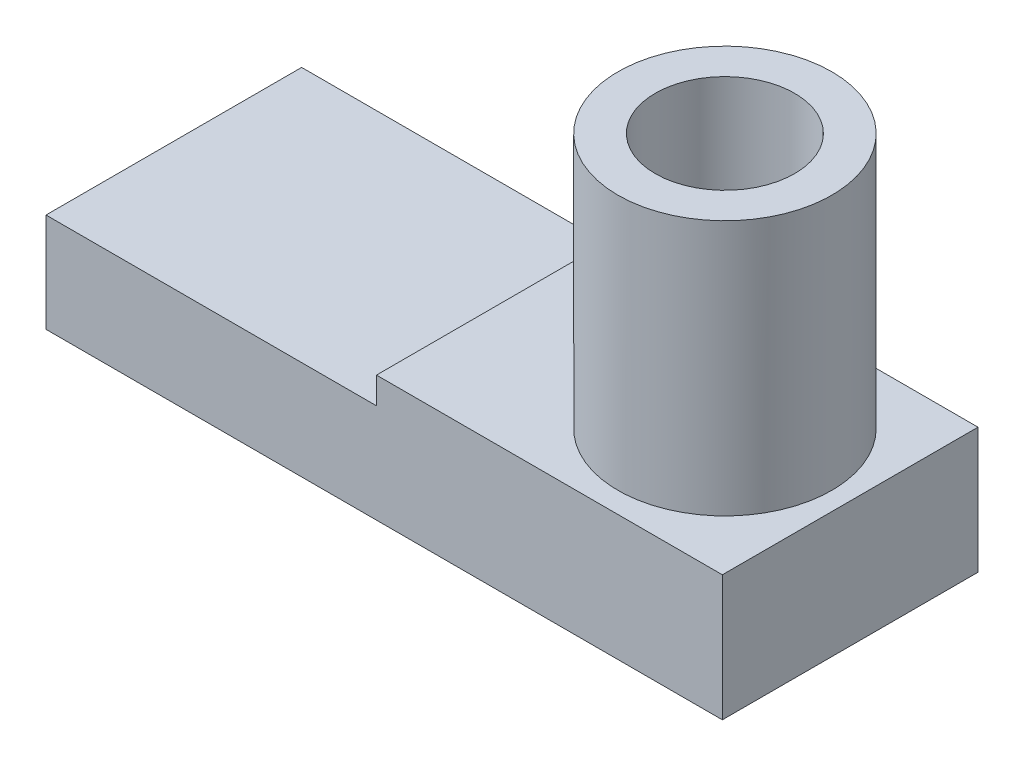
ISO-10303-21;
HEADER;
FILE_DESCRIPTION(('STEP AP214'),'2;1');
FILE_NAME('part.step','',(''),(''),'','','');
FILE_SCHEMA(('AUTOMOTIVE_DESIGN { 1 0 10303 214 1 1 1 1 }'));
ENDSEC;
DATA;
#1=APPLICATION_CONTEXT('core data for automotive mechanical design processes');
#2=APPLICATION_PROTOCOL_DEFINITION('international standard','automotive_design',2000,#1);
#3=PRODUCT_CONTEXT('',#1,'mechanical');
#4=PRODUCT('Part','Part','',(#3));
#5=PRODUCT_RELATED_PRODUCT_CATEGORY('part','',(#4));
#6=PRODUCT_DEFINITION_FORMATION('','',#4);
#7=PRODUCT_DEFINITION_CONTEXT('part definition',#1,'design');
#8=PRODUCT_DEFINITION('design','',#6,#7);
#9=PRODUCT_DEFINITION_SHAPE('','',#8);
#10=(LENGTH_UNIT() NAMED_UNIT(*) SI_UNIT(.MILLI.,.METRE.));
#11=(NAMED_UNIT(*) PLANE_ANGLE_UNIT() SI_UNIT($,.RADIAN.));
#12=(NAMED_UNIT(*) SI_UNIT($,.STERADIAN.) SOLID_ANGLE_UNIT());
#13=UNCERTAINTY_MEASURE_WITH_UNIT(LENGTH_MEASURE(1.E-05),#10,'distance_accuracy_value','');
#14=(GEOMETRIC_REPRESENTATION_CONTEXT(3) GLOBAL_UNCERTAINTY_ASSIGNED_CONTEXT((#13)) GLOBAL_UNIT_ASSIGNED_CONTEXT((#10,
#11,#12)) REPRESENTATION_CONTEXT('',''));
#15=CARTESIAN_POINT('',(0.,0.,0.));
#16=DIRECTION('',(0.,0.,1.));
#17=DIRECTION('',(1.,0.,0.));
#18=AXIS2_PLACEMENT_3D('',#15,#16,#17);
#19=CARTESIAN_POINT('',(158.7399347364,0.,30.));
#20=DIRECTION('',(0.,1.,0.));
#21=DIRECTION('',(0.,0.,1.));
#22=AXIS2_PLACEMENT_3D('',#19,#20,#21);
#23=PLANE('',#22);
#24=DIRECTION('',(1.,0.,0.));
#25=VECTOR('',#24,1.);
#26=CARTESIAN_POINT('',(158.7399347364,0.,-30.));
#27=LINE('',#26,#25);
#28=CARTESIAN_POINT('',(0.,0.,-30.));
#29=VERTEX_POINT('',#28);
#30=CARTESIAN_POINT('',(158.7399347364,0.,-30.));
#31=VERTEX_POINT('',#30);
#32=EDGE_CURVE('E124',#29,#31,#27,.T.);
#33=ORIENTED_EDGE('',*,*,#32,.T.);
#34=DIRECTION('',(0.,0.,-1.));
#35=VECTOR('',#34,1.);
#36=CARTESIAN_POINT('',(158.7399347364,0.,30.));
#37=LINE('',#36,#35);
#38=CARTESIAN_POINT('',(158.7399347364,0.,30.));
#39=VERTEX_POINT('',#38);
#40=EDGE_CURVE('E47',#39,#31,#37,.T.);
#41=ORIENTED_EDGE('',*,*,#40,.F.);
#42=DIRECTION('',(1.,0.,0.));
#43=VECTOR('',#42,1.);
#44=CARTESIAN_POINT('',(158.7399347364,0.,30.));
#45=LINE('',#44,#43);
#46=CARTESIAN_POINT('',(0.,0.,30.));
#47=VERTEX_POINT('',#46);
#48=EDGE_CURVE('E135',#47,#39,#45,.T.);
#49=ORIENTED_EDGE('',*,*,#48,.F.);
#50=DIRECTION('',(0.,0.,-1.));
#51=VECTOR('',#50,1.);
#52=CARTESIAN_POINT('',(0.,0.,30.));
#53=LINE('',#52,#51);
#54=EDGE_CURVE('E120',#47,#29,#53,.T.);
#55=ORIENTED_EDGE('',*,*,#54,.T.);
#56=EDGE_LOOP('',(#33,#41,#49,#55));
#57=FACE_BOUND('',#56,.T.);
#58=ADVANCED_FACE('F39',(#57),#23,.F.);
#59=CARTESIAN_POINT('',(158.7399347364,29.4886255287557,30.));
#60=DIRECTION('',(-1.,0.,0.));
#61=DIRECTION('',(0.,0.,1.));
#62=AXIS2_PLACEMENT_3D('',#59,#60,#61);
#63=PLANE('',#62);
#64=DIRECTION('',(0.,1.,0.));
#65=VECTOR('',#64,1.);
#66=CARTESIAN_POINT('',(158.7399347364,29.4886255287557,-30.));
#67=LINE('',#66,#65);
#68=CARTESIAN_POINT('',(158.7399347364,29.4886255287557,-30.));
#69=VERTEX_POINT('',#68);
#70=EDGE_CURVE('E127',#31,#69,#67,.T.);
#71=ORIENTED_EDGE('',*,*,#70,.T.);
#72=DIRECTION('',(0.,0.,-1.));
#73=VECTOR('',#72,1.);
#74=CARTESIAN_POINT('',(158.7399347364,29.4886255287557,30.));
#75=LINE('',#74,#73);
#76=CARTESIAN_POINT('',(158.7399347364,29.4886255287557,30.));
#77=VERTEX_POINT('',#76);
#78=EDGE_CURVE('E139',#77,#69,#75,.T.);
#79=ORIENTED_EDGE('',*,*,#78,.F.);
#80=DIRECTION('',(0.,1.,0.));
#81=VECTOR('',#80,1.);
#82=CARTESIAN_POINT('',(158.7399347364,29.4886255287557,30.));
#83=LINE('',#82,#81);
#84=EDGE_CURVE('E93',#39,#77,#83,.T.);
#85=ORIENTED_EDGE('',*,*,#84,.F.);
#86=ORIENTED_EDGE('',*,*,#40,.T.);
#87=EDGE_LOOP('',(#71,#79,#85,#86));
#88=FACE_BOUND('',#87,.T.);
#89=ADVANCED_FACE('F142',(#88),#63,.F.);
#90=CARTESIAN_POINT('',(77.5618368291332,29.4886255287557,30.));
#91=DIRECTION('',(0.,-1.,0.));
#92=DIRECTION('',(0.,0.,-1.));
#93=AXIS2_PLACEMENT_3D('',#90,#91,#92);
#94=PLANE('',#93);
#95=CARTESIAN_POINT('',(129.340120447867,29.4886255287557,0.));
#96=DIRECTION('',(0.,-1.,0.));
#97=DIRECTION('',(0.,0.,-1.));
#98=AXIS2_PLACEMENT_3D('',#95,#96,#97);
#99=CIRCLE('',#98,25.1043535275904);
#100=CARTESIAN_POINT('',(129.340120447867,29.4886255287557,-25.1043535275904));
#101=VERTEX_POINT('',#100);
#102=EDGE_CURVE('E11',#101,#101,#99,.F.);
#103=ORIENTED_EDGE('',*,*,#102,.F.);
#104=EDGE_LOOP('',(#103));
#105=FACE_BOUND('',#104,.T.);
#106=DIRECTION('',(-1.,0.,0.));
#107=VECTOR('',#106,1.);
#108=CARTESIAN_POINT('',(77.5618368291332,29.4886255287557,-30.));
#109=LINE('',#108,#107);
#110=CARTESIAN_POINT('',(77.5618368291332,29.4886255287557,-30.));
#111=VERTEX_POINT('',#110);
#112=EDGE_CURVE('E130',#69,#111,#109,.T.);
#113=ORIENTED_EDGE('',*,*,#112,.T.);
#114=DIRECTION('',(0.,0.,-1.));
#115=VECTOR('',#114,1.);
#116=CARTESIAN_POINT('',(77.5618368291332,29.4886255287557,30.));
#117=LINE('',#116,#115);
#118=CARTESIAN_POINT('',(77.5618368291332,29.4886255287557,30.));
#119=VERTEX_POINT('',#118);
#120=EDGE_CURVE('E115',#119,#111,#117,.T.);
#121=ORIENTED_EDGE('',*,*,#120,.F.);
#122=DIRECTION('',(-1.,0.,0.));
#123=VECTOR('',#122,1.);
#124=CARTESIAN_POINT('',(77.5618368291332,29.4886255287557,30.));
#125=LINE('',#124,#123);
#126=EDGE_CURVE('E106',#77,#119,#125,.T.);
#127=ORIENTED_EDGE('',*,*,#126,.F.);
#128=ORIENTED_EDGE('',*,*,#78,.T.);
#129=EDGE_LOOP('',(#113,#121,#127,#128));
#130=FACE_BOUND('',#129,.T.);
#131=ADVANCED_FACE('F150',(#105,#130),#94,.F.);
#132=CARTESIAN_POINT('',(77.5618368291332,23.2423563937973,30.));
#133=DIRECTION('',(1.,0.,0.));
#134=DIRECTION('',(0.,0.,-1.));
#135=AXIS2_PLACEMENT_3D('',#132,#133,#134);
#136=PLANE('',#135);
#137=DIRECTION('',(0.,-1.,0.));
#138=VECTOR('',#137,1.);
#139=CARTESIAN_POINT('',(77.5618368291332,23.2423563937973,-30.));
#140=LINE('',#139,#138);
#141=CARTESIAN_POINT('',(77.5618368291332,23.2423563937973,-30.));
#142=VERTEX_POINT('',#141);
#143=EDGE_CURVE('E114',#111,#142,#140,.T.);
#144=ORIENTED_EDGE('',*,*,#143,.T.);
#145=DIRECTION('',(0.,0.,-1.));
#146=VECTOR('',#145,1.);
#147=CARTESIAN_POINT('',(77.5618368291332,23.2423563937973,30.));
#148=LINE('',#147,#146);
#149=CARTESIAN_POINT('',(77.5618368291332,23.2423563937973,30.));
#150=VERTEX_POINT('',#149);
#151=EDGE_CURVE('E111',#150,#142,#148,.T.);
#152=ORIENTED_EDGE('',*,*,#151,.F.);
#153=DIRECTION('',(0.,-1.,0.));
#154=VECTOR('',#153,1.);
#155=CARTESIAN_POINT('',(77.5618368291332,23.2423563937973,30.));
#156=LINE('',#155,#154);
#157=EDGE_CURVE('E100',#119,#150,#156,.T.);
#158=ORIENTED_EDGE('',*,*,#157,.F.);
#159=ORIENTED_EDGE('',*,*,#120,.T.);
#160=EDGE_LOOP('',(#144,#152,#158,#159));
#161=FACE_BOUND('',#160,.T.);
#162=ADVANCED_FACE('F112',(#161),#136,.F.);
#163=CARTESIAN_POINT('',(0.,23.2423563937973,30.));
#164=DIRECTION('',(0.,-1.,0.));
#165=DIRECTION('',(0.,0.,-1.));
#166=AXIS2_PLACEMENT_3D('',#163,#164,#165);
#167=PLANE('',#166);
#168=DIRECTION('',(-1.,0.,0.));
#169=VECTOR('',#168,1.);
#170=CARTESIAN_POINT('',(0.,23.2423563937973,-30.));
#171=LINE('',#170,#169);
#172=CARTESIAN_POINT('',(0.,23.2423563937973,-30.));
#173=VERTEX_POINT('',#172);
#174=EDGE_CURVE('E78',#142,#173,#171,.T.);
#175=ORIENTED_EDGE('',*,*,#174,.T.);
#176=DIRECTION('',(0.,0.,-1.));
#177=VECTOR('',#176,1.);
#178=CARTESIAN_POINT('',(0.,23.2423563937973,30.));
#179=LINE('',#178,#177);
#180=CARTESIAN_POINT('',(0.,23.2423563937973,30.));
#181=VERTEX_POINT('',#180);
#182=EDGE_CURVE('E116',#181,#173,#179,.T.);
#183=ORIENTED_EDGE('',*,*,#182,.F.);
#184=DIRECTION('',(-1.,0.,0.));
#185=VECTOR('',#184,1.);
#186=CARTESIAN_POINT('',(0.,23.2423563937973,30.));
#187=LINE('',#186,#185);
#188=EDGE_CURVE('E104',#150,#181,#187,.T.);
#189=ORIENTED_EDGE('',*,*,#188,.F.);
#190=ORIENTED_EDGE('',*,*,#151,.T.);
#191=EDGE_LOOP('',(#175,#183,#189,#190));
#192=FACE_BOUND('',#191,.T.);
#193=ADVANCED_FACE('F118',(#192),#167,.F.);
#194=CARTESIAN_POINT('',(0.,0.,30.));
#195=DIRECTION('',(1.,0.,0.));
#196=DIRECTION('',(0.,0.,-1.));
#197=AXIS2_PLACEMENT_3D('',#194,#195,#196);
#198=PLANE('',#197);
#199=DIRECTION('',(0.,-1.,0.));
#200=VECTOR('',#199,1.);
#201=CARTESIAN_POINT('',(0.,0.,-30.));
#202=LINE('',#201,#200);
#203=EDGE_CURVE('E84',#173,#29,#202,.T.);
#204=ORIENTED_EDGE('',*,*,#203,.T.);
#205=ORIENTED_EDGE('',*,*,#54,.F.);
#206=DIRECTION('',(0.,-1.,0.));
#207=VECTOR('',#206,1.);
#208=CARTESIAN_POINT('',(0.,0.,30.));
#209=LINE('',#208,#207);
#210=EDGE_CURVE('E55',#181,#47,#209,.T.);
#211=ORIENTED_EDGE('',*,*,#210,.F.);
#212=ORIENTED_EDGE('',*,*,#182,.T.);
#213=EDGE_LOOP('',(#204,#205,#211,#212));
#214=FACE_BOUND('',#213,.T.);
#215=ADVANCED_FACE('F194',(#214),#198,.F.);
#216=CARTESIAN_POINT('',(0.,0.,30.));
#217=DIRECTION('',(0.,0.,-1.));
#218=DIRECTION('',(-1.,0.,0.));
#219=AXIS2_PLACEMENT_3D('',#216,#217,#218);
#220=PLANE('',#219);
#221=ORIENTED_EDGE('',*,*,#48,.T.);
#222=ORIENTED_EDGE('',*,*,#84,.T.);
#223=ORIENTED_EDGE('',*,*,#126,.T.);
#224=ORIENTED_EDGE('',*,*,#157,.T.);
#225=ORIENTED_EDGE('',*,*,#188,.T.);
#226=ORIENTED_EDGE('',*,*,#210,.T.);
#227=EDGE_LOOP('',(#221,#222,#223,#224,#225,#226));
#228=FACE_BOUND('',#227,.T.);
#229=ADVANCED_FACE('F102',(#228),#220,.F.);
#230=CARTESIAN_POINT('',(0.,0.,-30.));
#231=DIRECTION('',(0.,0.,-1.));
#232=DIRECTION('',(-1.,0.,0.));
#233=AXIS2_PLACEMENT_3D('',#230,#231,#232);
#234=PLANE('',#233);
#235=ORIENTED_EDGE('',*,*,#32,.F.);
#236=ORIENTED_EDGE('',*,*,#203,.F.);
#237=ORIENTED_EDGE('',*,*,#174,.F.);
#238=ORIENTED_EDGE('',*,*,#143,.F.);
#239=ORIENTED_EDGE('',*,*,#112,.F.);
#240=ORIENTED_EDGE('',*,*,#70,.F.);
#241=EDGE_LOOP('',(#235,#236,#237,#238,#239,#240));
#242=FACE_BOUND('',#241,.T.);
#243=ADVANCED_FACE('F147',(#242),#234,.T.);
#244=CARTESIAN_POINT('',(129.340120447867,89.4886255287557,0.));
#245=DIRECTION('',(0.,1.,0.));
#246=DIRECTION('',(0.,0.,1.));
#247=AXIS2_PLACEMENT_3D('',#244,#245,#246);
#248=PLANE('',#247);
#249=CARTESIAN_POINT('',(129.340120447867,89.4886255287557,0.));
#250=DIRECTION('',(0.,1.,0.));
#251=DIRECTION('',(0.,0.,1.));
#252=AXIS2_PLACEMENT_3D('',#249,#250,#251);
#253=CIRCLE('',#252,25.1043535275904);
#254=CARTESIAN_POINT('',(129.340120447867,89.4886255287557,25.1043535275904));
#255=VERTEX_POINT('',#254);
#256=EDGE_CURVE('E128',#255,#255,#253,.T.);
#257=ORIENTED_EDGE('',*,*,#256,.T.);
#258=EDGE_LOOP('',(#257));
#259=FACE_BOUND('',#258,.T.);
#260=CARTESIAN_POINT('',(129.340120447867,89.4886255287557,0.));
#261=DIRECTION('',(0.,1.,0.));
#262=DIRECTION('',(0.,0.,1.));
#263=AXIS2_PLACEMENT_3D('',#260,#261,#262);
#264=CIRCLE('',#263,16.35241319749);
#265=CARTESIAN_POINT('',(129.340120447867,89.4886255287557,16.35241319749));
#266=VERTEX_POINT('',#265);
#267=EDGE_CURVE('E156',#266,#266,#264,.T.);
#268=ORIENTED_EDGE('',*,*,#267,.F.);
#269=EDGE_LOOP('',(#268));
#270=FACE_BOUND('',#269,.T.);
#271=ADVANCED_FACE('F166',(#259,#270),#248,.T.);
#272=CARTESIAN_POINT('',(129.340120447867,89.4886255287557,0.));
#273=DIRECTION('',(0.,-1.,0.));
#274=DIRECTION('',(0.,0.,-1.));
#275=AXIS2_PLACEMENT_3D('',#272,#273,#274);
#276=CYLINDRICAL_SURFACE('',#275,25.1043535275904);
#277=ORIENTED_EDGE('',*,*,#256,.F.);
#278=EDGE_LOOP('',(#277));
#279=FACE_BOUND('',#278,.T.);
#280=ORIENTED_EDGE('',*,*,#102,.T.);
#281=EDGE_LOOP('',(#280));
#282=FACE_BOUND('',#281,.T.);
#283=ADVANCED_FACE('F168',(#279,#282),#276,.T.);
#284=CARTESIAN_POINT('',(129.340120447867,89.4886255287557,0.));
#285=DIRECTION('',(0.,-1.,0.));
#286=DIRECTION('',(0.,0.,-1.));
#287=AXIS2_PLACEMENT_3D('',#284,#285,#286);
#288=CYLINDRICAL_SURFACE('',#287,16.35241319749);
#289=ORIENTED_EDGE('',*,*,#267,.T.);
#290=EDGE_LOOP('',(#289));
#291=FACE_BOUND('',#290,.T.);
#292=CARTESIAN_POINT('',(129.340120447867,29.4886255287557,0.));
#293=DIRECTION('',(0.,1.,0.));
#294=DIRECTION('',(0.,0.,1.));
#295=AXIS2_PLACEMENT_3D('',#292,#293,#294);
#296=CIRCLE('',#295,16.35241319749);
#297=CARTESIAN_POINT('',(129.340120447867,29.4886255287557,16.35241319749));
#298=VERTEX_POINT('',#297);
#299=EDGE_CURVE('E157',#298,#298,#296,.T.);
#300=ORIENTED_EDGE('',*,*,#299,.F.);
#301=EDGE_LOOP('',(#300));
#302=FACE_BOUND('',#301,.T.);
#303=ADVANCED_FACE('F163',(#291,#302),#288,.F.);
#304=ORIENTED_EDGE('',*,*,#299,.T.);
#305=EDGE_LOOP('',(#304));
#306=FACE_BOUND('',#305,.T.);
#307=ADVANCED_FACE('F188',(#306),#94,.F.);
#308=CLOSED_SHELL('',(#58,#89,#131,#162,#193,#215,#229,#243,#271,#283,#303,#307));
#309=MANIFOLD_SOLID_BREP('B2',#308);
#310=ADVANCED_BREP_SHAPE_REPRESENTATION('',(#18,#309),#14);
#311=SHAPE_DEFINITION_REPRESENTATION(#9,#310);
ENDSEC;
END-ISO-10303-21;
